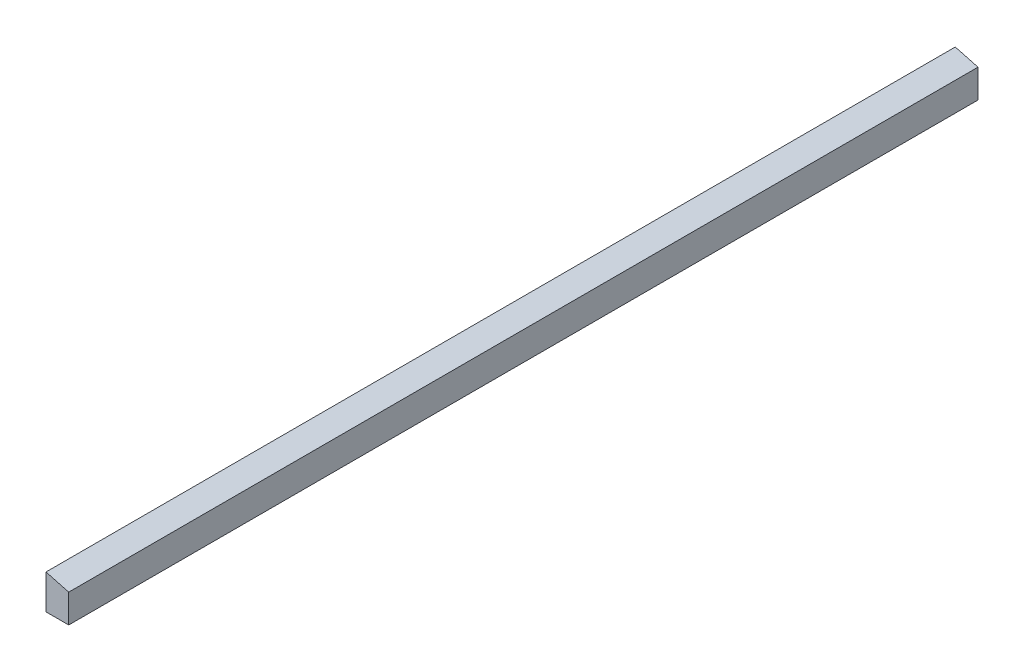
ISO-10303-21;
HEADER;
FILE_DESCRIPTION(('STEP AP214'),'2;1');
FILE_NAME('part.step','',(''),(''),'','','');
FILE_SCHEMA(('AUTOMOTIVE_DESIGN { 1 0 10303 214 1 1 1 1 }'));
ENDSEC;
DATA;
#1=APPLICATION_CONTEXT('core data for automotive mechanical design processes');
#2=APPLICATION_PROTOCOL_DEFINITION('international standard','automotive_design',2000,#1);
#3=PRODUCT_CONTEXT('',#1,'mechanical');
#4=PRODUCT('Part','Part','',(#3));
#5=PRODUCT_RELATED_PRODUCT_CATEGORY('part','',(#4));
#6=PRODUCT_DEFINITION_FORMATION('','',#4);
#7=PRODUCT_DEFINITION_CONTEXT('part definition',#1,'design');
#8=PRODUCT_DEFINITION('design','',#6,#7);
#9=PRODUCT_DEFINITION_SHAPE('','',#8);
#10=(LENGTH_UNIT() NAMED_UNIT(*) SI_UNIT(.MILLI.,.METRE.));
#11=(NAMED_UNIT(*) PLANE_ANGLE_UNIT() SI_UNIT($,.RADIAN.));
#12=(NAMED_UNIT(*) SI_UNIT($,.STERADIAN.) SOLID_ANGLE_UNIT());
#13=UNCERTAINTY_MEASURE_WITH_UNIT(LENGTH_MEASURE(1.E-05),#10,'distance_accuracy_value','');
#14=(GEOMETRIC_REPRESENTATION_CONTEXT(3) GLOBAL_UNCERTAINTY_ASSIGNED_CONTEXT((#13)) GLOBAL_UNIT_ASSIGNED_CONTEXT((#10,
#11,#12)) REPRESENTATION_CONTEXT('',''));
#15=CARTESIAN_POINT('',(0.,0.,0.));
#16=DIRECTION('',(0.,0.,1.));
#17=DIRECTION('',(1.,0.,0.));
#18=AXIS2_PLACEMENT_3D('',#15,#16,#17);
#19=CARTESIAN_POINT('',(-22.7606381991584,27.4332757771279,1524.));
#20=DIRECTION('',(1.,0.,0.));
#21=DIRECTION('',(0.,0.,-1.));
#22=AXIS2_PLACEMENT_3D('',#19,#20,#21);
#23=PLANE('',#22);
#24=DIRECTION('',(0.,-1.,0.));
#25=VECTOR('',#24,1.);
#26=CARTESIAN_POINT('',(-22.7606381991584,27.4332757771279,0.));
#27=LINE('',#26,#25);
#28=CARTESIAN_POINT('',(-22.7606381991584,27.4332757771279,0.));
#29=VERTEX_POINT('',#28);
#30=CARTESIAN_POINT('',(-22.7606381991584,-30.5104742228721,0.));
#31=VERTEX_POINT('',#30);
#32=EDGE_CURVE('E95',#29,#31,#27,.T.);
#33=ORIENTED_EDGE('',*,*,#32,.T.);
#34=DIRECTION('',(0.,0.,-1.));
#35=VECTOR('',#34,1.);
#36=CARTESIAN_POINT('',(-22.7606381991584,-30.5104742228721,1524.));
#37=LINE('',#36,#35);
#38=CARTESIAN_POINT('',(-22.7606381991584,-30.5104742228721,1524.));
#39=VERTEX_POINT('',#38);
#40=EDGE_CURVE('E11',#39,#31,#37,.T.);
#41=ORIENTED_EDGE('',*,*,#40,.F.);
#42=DIRECTION('',(0.,-1.,0.));
#43=VECTOR('',#42,1.);
#44=CARTESIAN_POINT('',(-22.7606381991584,27.4332757771279,1524.));
#45=LINE('',#44,#43);
#46=CARTESIAN_POINT('',(-22.7606381991584,27.4332757771279,1524.));
#47=VERTEX_POINT('',#46);
#48=EDGE_CURVE('E83',#47,#39,#45,.T.);
#49=ORIENTED_EDGE('',*,*,#48,.F.);
#50=DIRECTION('',(0.,0.,-1.));
#51=VECTOR('',#50,1.);
#52=CARTESIAN_POINT('',(-22.7606381991584,27.4332757771279,1524.));
#53=LINE('',#52,#51);
#54=EDGE_CURVE('E91',#47,#29,#53,.T.);
#55=ORIENTED_EDGE('',*,*,#54,.T.);
#56=EDGE_LOOP('',(#33,#41,#49,#55));
#57=FACE_BOUND('',#56,.T.);
#58=ADVANCED_FACE('F32',(#57),#23,.F.);
#59=CARTESIAN_POINT('',(-22.7606381991584,-30.5104742228721,1524.));
#60=DIRECTION('',(0.,1.,0.));
#61=DIRECTION('',(-1.,0.,0.));
#62=AXIS2_PLACEMENT_3D('',#59,#60,#61);
#63=PLANE('',#62);
#64=DIRECTION('',(1.,0.,0.));
#65=VECTOR('',#64,1.);
#66=CARTESIAN_POINT('',(-22.7606381991584,-30.5104742228721,0.));
#67=LINE('',#66,#65);
#68=CARTESIAN_POINT('',(15.3393618008416,-30.5104742228721,0.));
#69=VERTEX_POINT('',#68);
#70=EDGE_CURVE('E87',#31,#69,#67,.T.);
#71=ORIENTED_EDGE('',*,*,#70,.T.);
#72=DIRECTION('',(0.,0.,-1.));
#73=VECTOR('',#72,1.);
#74=CARTESIAN_POINT('',(15.3393618008416,-30.5104742228721,1524.));
#75=LINE('',#74,#73);
#76=CARTESIAN_POINT('',(15.3393618008416,-30.5104742228721,1524.));
#77=VERTEX_POINT('',#76);
#78=EDGE_CURVE('E40',#77,#69,#75,.T.);
#79=ORIENTED_EDGE('',*,*,#78,.F.);
#80=DIRECTION('',(1.,0.,0.));
#81=VECTOR('',#80,1.);
#82=CARTESIAN_POINT('',(-22.7606381991584,-30.5104742228721,1524.));
#83=LINE('',#82,#81);
#84=EDGE_CURVE('E78',#39,#77,#83,.T.);
#85=ORIENTED_EDGE('',*,*,#84,.F.);
#86=ORIENTED_EDGE('',*,*,#40,.T.);
#87=EDGE_LOOP('',(#71,#79,#85,#86));
#88=FACE_BOUND('',#87,.T.);
#89=ADVANCED_FACE('F86',(#88),#63,.F.);
#90=CARTESIAN_POINT('',(15.3393618008416,17.2244115455023,1524.));
#91=DIRECTION('',(-1.,0.,0.));
#92=DIRECTION('',(0.,-1.,0.));
#93=AXIS2_PLACEMENT_3D('',#90,#91,#92);
#94=PLANE('',#93);
#95=DIRECTION('',(0.,1.,0.));
#96=VECTOR('',#95,1.);
#97=CARTESIAN_POINT('',(15.3393618008416,17.2244115455023,0.));
#98=LINE('',#97,#96);
#99=CARTESIAN_POINT('',(15.3393618008416,17.2244115455023,0.));
#100=VERTEX_POINT('',#99);
#101=EDGE_CURVE('E65',#69,#100,#98,.T.);
#102=ORIENTED_EDGE('',*,*,#101,.T.);
#103=DIRECTION('',(0.,0.,-1.));
#104=VECTOR('',#103,1.);
#105=CARTESIAN_POINT('',(15.3393618008416,17.2244115455023,1524.));
#106=LINE('',#105,#104);
#107=CARTESIAN_POINT('',(15.3393618008416,17.2244115455023,1524.));
#108=VERTEX_POINT('',#107);
#109=EDGE_CURVE('E88',#108,#100,#106,.T.);
#110=ORIENTED_EDGE('',*,*,#109,.F.);
#111=DIRECTION('',(0.,1.,0.));
#112=VECTOR('',#111,1.);
#113=CARTESIAN_POINT('',(15.3393618008416,17.2244115455023,1524.));
#114=LINE('',#113,#112);
#115=EDGE_CURVE('E81',#77,#108,#114,.T.);
#116=ORIENTED_EDGE('',*,*,#115,.F.);
#117=ORIENTED_EDGE('',*,*,#78,.T.);
#118=EDGE_LOOP('',(#102,#110,#116,#117));
#119=FACE_BOUND('',#118,.T.);
#120=ADVANCED_FACE('F89',(#119),#94,.F.);
#121=CARTESIAN_POINT('',(-22.7606381991584,27.4332757771279,1524.));
#122=DIRECTION('',(-0.258819045102517,-0.965925826289069,0.));
#123=DIRECTION('',(0.965925826289069,-0.258819045102518,0.));
#124=AXIS2_PLACEMENT_3D('',#121,#122,#123);
#125=PLANE('',#124);
#126=DIRECTION('',(-0.965925826289069,0.258819045102518,0.));
#127=VECTOR('',#126,1.);
#128=CARTESIAN_POINT('',(-22.7606381991584,27.4332757771279,0.));
#129=LINE('',#128,#127);
#130=EDGE_CURVE('E71',#100,#29,#129,.T.);
#131=ORIENTED_EDGE('',*,*,#130,.T.);
#132=ORIENTED_EDGE('',*,*,#54,.F.);
#133=DIRECTION('',(-0.965925826289069,0.258819045102518,0.));
#134=VECTOR('',#133,1.);
#135=CARTESIAN_POINT('',(-22.7606381991584,27.4332757771279,1524.));
#136=LINE('',#135,#134);
#137=EDGE_CURVE('E48',#108,#47,#136,.T.);
#138=ORIENTED_EDGE('',*,*,#137,.F.);
#139=ORIENTED_EDGE('',*,*,#109,.T.);
#140=EDGE_LOOP('',(#131,#132,#138,#139));
#141=FACE_BOUND('',#140,.T.);
#142=ADVANCED_FACE('F102',(#141),#125,.F.);
#143=CARTESIAN_POINT('',(0.,0.,1524.));
#144=DIRECTION('',(0.,0.,1.));
#145=DIRECTION('',(1.,0.,0.));
#146=AXIS2_PLACEMENT_3D('',#143,#144,#145);
#147=PLANE('',#146);
#148=ORIENTED_EDGE('',*,*,#48,.T.);
#149=ORIENTED_EDGE('',*,*,#84,.T.);
#150=ORIENTED_EDGE('',*,*,#115,.T.);
#151=ORIENTED_EDGE('',*,*,#137,.T.);
#152=EDGE_LOOP('',(#148,#149,#150,#151));
#153=FACE_BOUND('',#152,.T.);
#154=ADVANCED_FACE('F79',(#153),#147,.T.);
#155=CARTESIAN_POINT('',(0.,0.,0.));
#156=DIRECTION('',(0.,0.,1.));
#157=DIRECTION('',(1.,0.,0.));
#158=AXIS2_PLACEMENT_3D('',#155,#156,#157);
#159=PLANE('',#158);
#160=ORIENTED_EDGE('',*,*,#32,.F.);
#161=ORIENTED_EDGE('',*,*,#130,.F.);
#162=ORIENTED_EDGE('',*,*,#101,.F.);
#163=ORIENTED_EDGE('',*,*,#70,.F.);
#164=EDGE_LOOP('',(#160,#161,#162,#163));
#165=FACE_BOUND('',#164,.T.);
#166=ADVANCED_FACE('F105',(#165),#159,.F.);
#167=CLOSED_SHELL('',(#58,#89,#120,#142,#154,#166));
#168=MANIFOLD_SOLID_BREP('B2',#167);
#169=ADVANCED_BREP_SHAPE_REPRESENTATION('',(#18,#168),#14);
#170=SHAPE_DEFINITION_REPRESENTATION(#9,#169);
ENDSEC;
END-ISO-10303-21;
